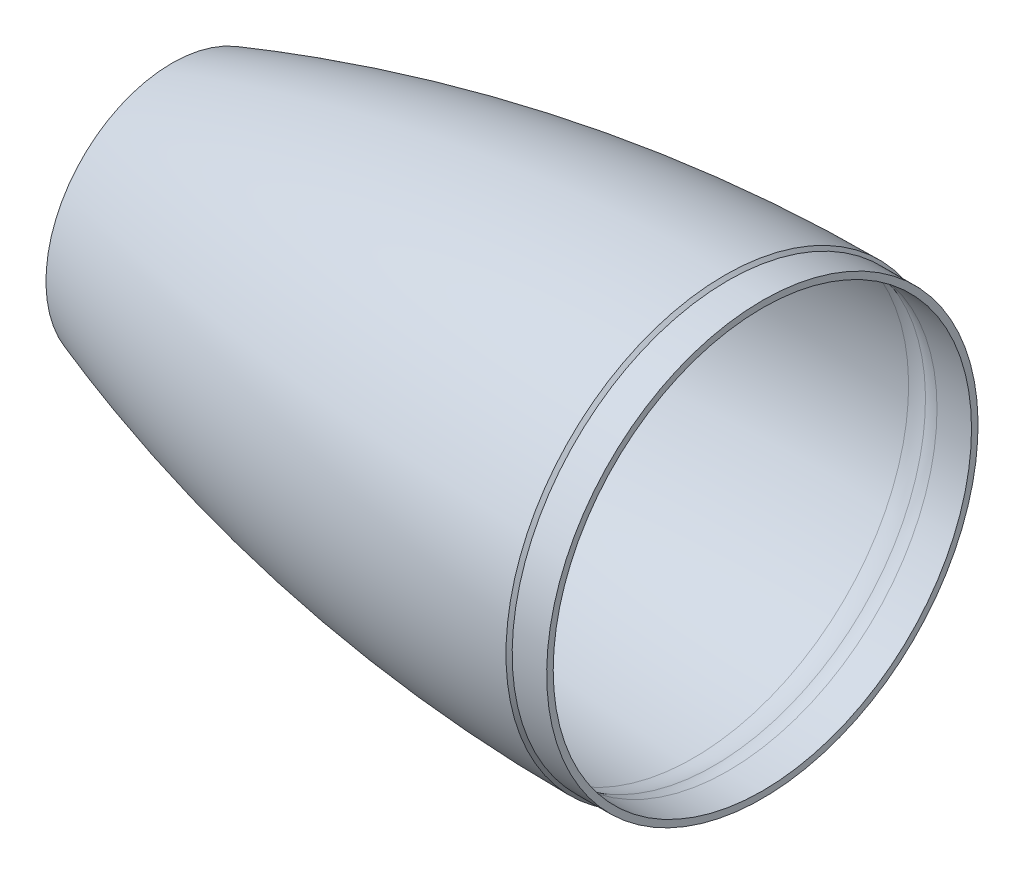
ISO-10303-21;
HEADER;
FILE_DESCRIPTION(('STEP AP214'),'2;1');
FILE_NAME('part.step','',(''),(''),'','','');
FILE_SCHEMA(('AUTOMOTIVE_DESIGN { 1 0 10303 214 1 1 1 1 }'));
ENDSEC;
DATA;
#1=APPLICATION_CONTEXT('core data for automotive mechanical design processes');
#2=APPLICATION_PROTOCOL_DEFINITION('international standard','automotive_design',2000,#1);
#3=PRODUCT_CONTEXT('',#1,'mechanical');
#4=PRODUCT('Part','Part','',(#3));
#5=PRODUCT_RELATED_PRODUCT_CATEGORY('part','',(#4));
#6=PRODUCT_DEFINITION_FORMATION('','',#4);
#7=PRODUCT_DEFINITION_CONTEXT('part definition',#1,'design');
#8=PRODUCT_DEFINITION('design','',#6,#7);
#9=PRODUCT_DEFINITION_SHAPE('','',#8);
#10=(LENGTH_UNIT() NAMED_UNIT(*) SI_UNIT(.MILLI.,.METRE.));
#11=(NAMED_UNIT(*) PLANE_ANGLE_UNIT() SI_UNIT($,.RADIAN.));
#12=(NAMED_UNIT(*) SI_UNIT($,.STERADIAN.) SOLID_ANGLE_UNIT());
#13=UNCERTAINTY_MEASURE_WITH_UNIT(LENGTH_MEASURE(1.E-05),#10,'distance_accuracy_value','');
#14=(GEOMETRIC_REPRESENTATION_CONTEXT(3) GLOBAL_UNCERTAINTY_ASSIGNED_CONTEXT((#13)) GLOBAL_UNIT_ASSIGNED_CONTEXT((#10,
#11,#12)) REPRESENTATION_CONTEXT('',''));
#15=CARTESIAN_POINT('',(0.,0.,0.));
#16=DIRECTION('',(0.,0.,1.));
#17=DIRECTION('',(1.,0.,0.));
#18=AXIS2_PLACEMENT_3D('',#15,#16,#17);
#19=CARTESIAN_POINT('',(0.,0.,0.));
#20=DIRECTION('',(1.,0.,0.));
#21=DIRECTION('',(0.,1.,0.));
#22=AXIS2_PLACEMENT_3D('',#19,#20,#21);
#23=DEGENERATE_TOROIDAL_SURFACE('',#22,542.387492565056,622.905492565056,.F.);
#24=CARTESIAN_POINT('',(-203.454,0.,0.));
#25=DIRECTION('',(1.,0.,0.));
#26=DIRECTION('',(0.,1.,0.));
#27=AXIS2_PLACEMENT_3D('',#24,#25,#26);
#28=CIRCLE('',#27,46.355);
#29=CARTESIAN_POINT('',(-203.454,46.355,0.));
#30=VERTEX_POINT('',#29);
#31=EDGE_CURVE('E10',#30,#30,#28,.T.);
#32=ORIENTED_EDGE('',*,*,#31,.T.);
#33=EDGE_LOOP('',(#32));
#34=FACE_BOUND('',#33,.T.);
#35=CARTESIAN_POINT('',(0.,0.,0.));
#36=DIRECTION('',(1.,0.,0.));
#37=DIRECTION('',(0.,1.,0.));
#38=AXIS2_PLACEMENT_3D('',#35,#36,#37);
#39=CIRCLE('',#38,80.518);
#40=CARTESIAN_POINT('',(0.,80.518,0.));
#41=VERTEX_POINT('',#40);
#42=EDGE_CURVE('E68',#41,#41,#39,.T.);
#43=ORIENTED_EDGE('',*,*,#42,.F.);
#44=EDGE_LOOP('',(#43));
#45=FACE_BOUND('',#44,.T.);
#46=ADVANCED_FACE('F37',(#34,#45),#23,.F.);
#47=CARTESIAN_POINT('',(-203.454,46.355,0.));
#48=DIRECTION('',(-1.,0.,0.));
#49=DIRECTION('',(0.,-1.,0.));
#50=AXIS2_PLACEMENT_3D('',#47,#48,#49);
#51=PLANE('',#50);
#52=CARTESIAN_POINT('',(-203.454,0.,0.));
#53=DIRECTION('',(1.,0.,0.));
#54=DIRECTION('',(0.,1.,0.));
#55=AXIS2_PLACEMENT_3D('',#52,#53,#54);
#56=CIRCLE('',#55,45.0852211583636);
#57=CARTESIAN_POINT('',(-203.454,45.0852211583636,0.));
#58=VERTEX_POINT('',#57);
#59=EDGE_CURVE('E43',#58,#58,#56,.T.);
#60=ORIENTED_EDGE('',*,*,#59,.T.);
#61=EDGE_LOOP('',(#60));
#62=FACE_BOUND('',#61,.T.);
#63=ORIENTED_EDGE('',*,*,#31,.F.);
#64=EDGE_LOOP('',(#63));
#65=FACE_BOUND('',#64,.T.);
#66=ADVANCED_FACE('F76',(#62,#65),#51,.T.);
#67=CARTESIAN_POINT('',(0.,0.,0.));
#68=DIRECTION('',(1.,0.,0.));
#69=DIRECTION('',(0.,1.,0.));
#70=AXIS2_PLACEMENT_3D('',#67,#68,#69);
#71=DEGENERATE_TOROIDAL_SURFACE('',#70,542.387492565056,621.705492565056,.F.);
#72=CARTESIAN_POINT('',(-11.557,0.,0.));
#73=DIRECTION('',(1.,0.,0.));
#74=DIRECTION('',(0.,1.,0.));
#75=AXIS2_PLACEMENT_3D('',#72,#73,#74);
#76=CIRCLE('',#75,79.210573098407);
#77=CARTESIAN_POINT('',(-11.557,79.210573098407,0.));
#78=VERTEX_POINT('',#77);
#79=EDGE_CURVE('E47',#78,#78,#76,.T.);
#80=ORIENTED_EDGE('',*,*,#79,.T.);
#81=EDGE_LOOP('',(#80));
#82=FACE_BOUND('',#81,.T.);
#83=ORIENTED_EDGE('',*,*,#59,.F.);
#84=EDGE_LOOP('',(#83));
#85=FACE_BOUND('',#84,.T.);
#86=ADVANCED_FACE('F80',(#82,#85),#71,.T.);
#87=CARTESIAN_POINT('',(-11.17995022867,0.,0.));
#88=DIRECTION('',(1.,0.,0.));
#89=DIRECTION('',(0.,1.,0.));
#90=AXIS2_PLACEMENT_3D('',#87,#88,#89);
#91=TOROIDAL_SURFACE('',#90,58.9307938721757,20.2832840534944);
#92=CARTESIAN_POINT('',(-4.04458467874521,0.,0.));
#93=DIRECTION('',(1.,0.,0.));
#94=DIRECTION('',(0.,1.,0.));
#95=AXIS2_PLACEMENT_3D('',#92,#93,#94);
#96=CIRCLE('',#95,77.9175832390931);
#97=CARTESIAN_POINT('',(-4.04458467874522,77.9175832390931,0.));
#98=VERTEX_POINT('',#97);
#99=EDGE_CURVE('E51',#98,#98,#96,.T.);
#100=ORIENTED_EDGE('',*,*,#99,.T.);
#101=EDGE_LOOP('',(#100));
#102=FACE_BOUND('',#101,.T.);
#103=ORIENTED_EDGE('',*,*,#79,.F.);
#104=EDGE_LOOP('',(#103));
#105=FACE_BOUND('',#104,.T.);
#106=ADVANCED_FACE('F84',(#102,#105),#91,.F.);
#107=CARTESIAN_POINT('',(1.143,0.,0.));
#108=DIRECTION('',(1.,0.,0.));
#109=DIRECTION('',(0.,1.,0.));
#110=AXIS2_PLACEMENT_3D('',#107,#108,#109);
#111=TOROIDAL_SURFACE('',#110,91.7214419102751,14.7464419102751);
#112=CARTESIAN_POINT('',(1.14299999999999,0.,0.));
#113=DIRECTION('',(1.,0.,0.));
#114=DIRECTION('',(0.,1.,0.));
#115=AXIS2_PLACEMENT_3D('',#112,#113,#114);
#116=CIRCLE('',#115,76.975);
#117=CARTESIAN_POINT('',(1.14299999999998,76.975,0.));
#118=VERTEX_POINT('',#117);
#119=EDGE_CURVE('E56',#118,#118,#116,.T.);
#120=ORIENTED_EDGE('',*,*,#119,.T.);
#121=EDGE_LOOP('',(#120));
#122=FACE_BOUND('',#121,.T.);
#123=ORIENTED_EDGE('',*,*,#99,.F.);
#124=EDGE_LOOP('',(#123));
#125=FACE_BOUND('',#124,.T.);
#126=ADVANCED_FACE('F91',(#122,#125),#111,.T.);
#127=CARTESIAN_POINT('',(0.,0.,0.));
#128=DIRECTION('',(1.,0.,0.));
#129=DIRECTION('',(0.,1.,0.));
#130=AXIS2_PLACEMENT_3D('',#127,#128,#129);
#131=CYLINDRICAL_SURFACE('',#130,76.975);
#132=CARTESIAN_POINT('',(13.843,0.,0.));
#133=DIRECTION('',(1.,0.,0.));
#134=DIRECTION('',(0.,1.,0.));
#135=AXIS2_PLACEMENT_3D('',#132,#133,#134);
#136=CIRCLE('',#135,76.975);
#137=CARTESIAN_POINT('',(13.843,76.975,0.));
#138=VERTEX_POINT('',#137);
#139=EDGE_CURVE('E59',#138,#138,#136,.T.);
#140=ORIENTED_EDGE('',*,*,#139,.T.);
#141=EDGE_LOOP('',(#140));
#142=FACE_BOUND('',#141,.T.);
#143=ORIENTED_EDGE('',*,*,#119,.F.);
#144=EDGE_LOOP('',(#143));
#145=FACE_BOUND('',#144,.T.);
#146=ADVANCED_FACE('F95',(#142,#145),#131,.F.);
#147=CARTESIAN_POINT('',(13.843,76.975,0.));
#148=DIRECTION('',(1.,0.,0.));
#149=DIRECTION('',(0.,1.,0.));
#150=AXIS2_PLACEMENT_3D('',#147,#148,#149);
#151=PLANE('',#150);
#152=CARTESIAN_POINT('',(13.843,0.,0.));
#153=DIRECTION('',(1.,0.,0.));
#154=DIRECTION('',(0.,1.,0.));
#155=AXIS2_PLACEMENT_3D('',#152,#153,#154);
#156=CIRCLE('',#155,79.375);
#157=CARTESIAN_POINT('',(13.843,79.375,0.));
#158=VERTEX_POINT('',#157);
#159=EDGE_CURVE('E62',#158,#158,#156,.T.);
#160=ORIENTED_EDGE('',*,*,#159,.T.);
#161=EDGE_LOOP('',(#160));
#162=FACE_BOUND('',#161,.T.);
#163=ORIENTED_EDGE('',*,*,#139,.F.);
#164=EDGE_LOOP('',(#163));
#165=FACE_BOUND('',#164,.T.);
#166=ADVANCED_FACE('F99',(#162,#165),#151,.T.);
#167=CARTESIAN_POINT('',(0.,0.,0.));
#168=DIRECTION('',(1.,0.,0.));
#169=DIRECTION('',(0.,1.,0.));
#170=AXIS2_PLACEMENT_3D('',#167,#168,#169);
#171=CYLINDRICAL_SURFACE('',#170,79.375);
#172=CARTESIAN_POINT('',(1.1429999999996,0.,0.));
#173=DIRECTION('',(1.,0.,0.));
#174=DIRECTION('',(0.,1.,0.));
#175=AXIS2_PLACEMENT_3D('',#172,#173,#174);
#176=CIRCLE('',#175,79.375);
#177=CARTESIAN_POINT('',(1.14299999999959,79.375,0.));
#178=VERTEX_POINT('',#177);
#179=EDGE_CURVE('E65',#178,#178,#176,.T.);
#180=ORIENTED_EDGE('',*,*,#179,.T.);
#181=EDGE_LOOP('',(#180));
#182=FACE_BOUND('',#181,.T.);
#183=ORIENTED_EDGE('',*,*,#159,.F.);
#184=EDGE_LOOP('',(#183));
#185=FACE_BOUND('',#184,.T.);
#186=ADVANCED_FACE('F103',(#182,#185),#171,.T.);
#187=CARTESIAN_POINT('',(1.1429999999996,0.,0.));
#188=DIRECTION('',(-1.,0.,0.));
#189=DIRECTION('',(0.,-1.,0.));
#190=AXIS2_PLACEMENT_3D('',#187,#188,#189);
#191=CONICAL_SURFACE('',#190,79.375,0.785398163397619);
#192=ORIENTED_EDGE('',*,*,#42,.T.);
#193=EDGE_LOOP('',(#192));
#194=FACE_BOUND('',#193,.T.);
#195=ORIENTED_EDGE('',*,*,#179,.F.);
#196=EDGE_LOOP('',(#195));
#197=FACE_BOUND('',#196,.T.);
#198=ADVANCED_FACE('F72',(#194,#197),#191,.T.);
#199=CLOSED_SHELL('',(#46,#66,#86,#106,#126,#146,#166,#186,#198));
#200=MANIFOLD_SOLID_BREP('B2',#199);
#201=ADVANCED_BREP_SHAPE_REPRESENTATION('',(#18,#200),#14);
#202=SHAPE_DEFINITION_REPRESENTATION(#9,#201);
ENDSEC;
END-ISO-10303-21;
